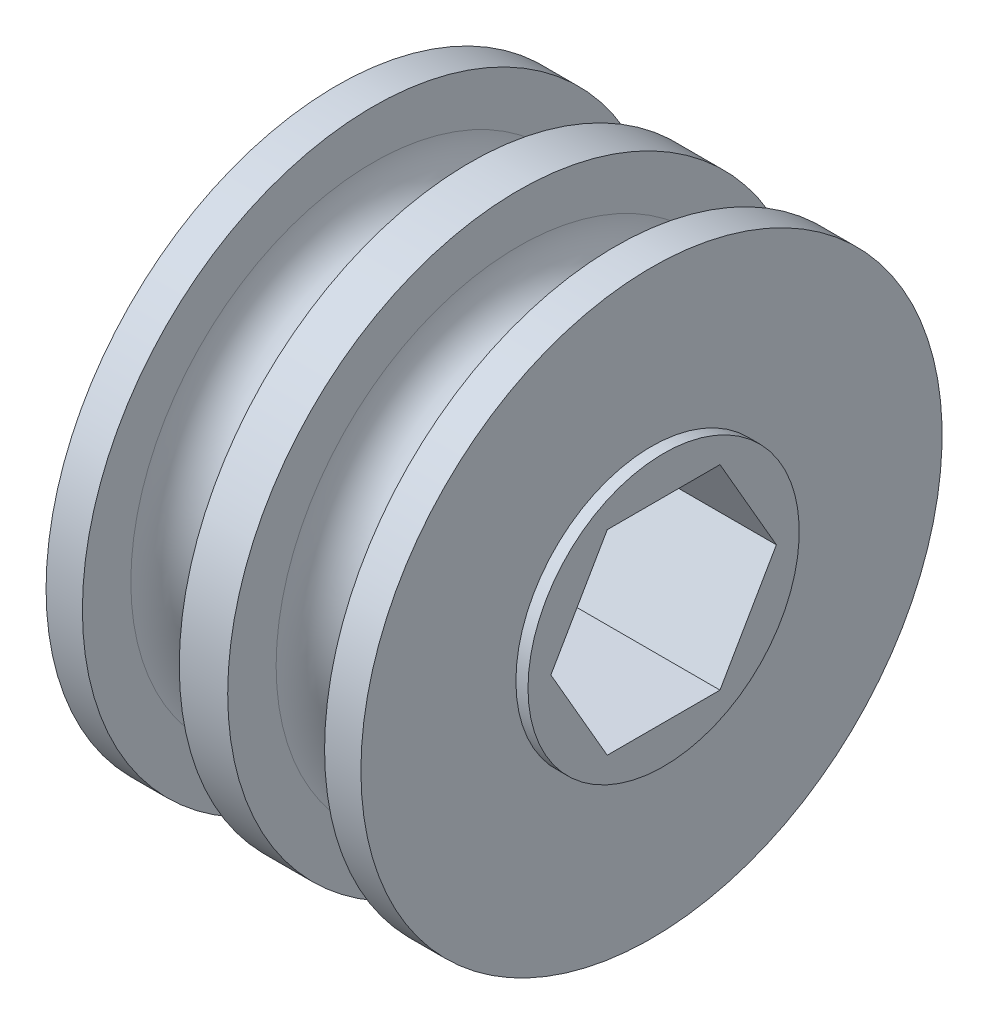
ISO-10303-21;
HEADER;
FILE_DESCRIPTION(('STEP AP214'),'2;1');
FILE_NAME('part.step','',(''),(''),'','','');
FILE_SCHEMA(('AUTOMOTIVE_DESIGN { 1 0 10303 214 1 1 1 1 }'));
ENDSEC;
DATA;
#1=APPLICATION_CONTEXT('core data for automotive mechanical design processes');
#2=APPLICATION_PROTOCOL_DEFINITION('international standard','automotive_design',2000,#1);
#3=PRODUCT_CONTEXT('',#1,'mechanical');
#4=PRODUCT('Part','Part','',(#3));
#5=PRODUCT_RELATED_PRODUCT_CATEGORY('part','',(#4));
#6=PRODUCT_DEFINITION_FORMATION('','',#4);
#7=PRODUCT_DEFINITION_CONTEXT('part definition',#1,'design');
#8=PRODUCT_DEFINITION('design','',#6,#7);
#9=PRODUCT_DEFINITION_SHAPE('','',#8);
#10=(LENGTH_UNIT() NAMED_UNIT(*) SI_UNIT(.MILLI.,.METRE.));
#11=(NAMED_UNIT(*) PLANE_ANGLE_UNIT() SI_UNIT($,.RADIAN.));
#12=(NAMED_UNIT(*) SI_UNIT($,.STERADIAN.) SOLID_ANGLE_UNIT());
#13=UNCERTAINTY_MEASURE_WITH_UNIT(LENGTH_MEASURE(1.E-05),#10,'distance_accuracy_value','');
#14=(GEOMETRIC_REPRESENTATION_CONTEXT(3) GLOBAL_UNCERTAINTY_ASSIGNED_CONTEXT((#13)) GLOBAL_UNIT_ASSIGNED_CONTEXT((#10,
#11,#12)) REPRESENTATION_CONTEXT('',''));
#15=CARTESIAN_POINT('',(0.,0.,0.));
#16=DIRECTION('',(0.,0.,1.));
#17=DIRECTION('',(1.,0.,0.));
#18=AXIS2_PLACEMENT_3D('',#15,#16,#17);
#19=CARTESIAN_POINT('',(-4.7625,0.,0.));
#20=DIRECTION('',(1.,0.,0.));
#21=DIRECTION('',(0.,0.,-1.));
#22=AXIS2_PLACEMENT_3D('',#19,#20,#21);
#23=TOROIDAL_SURFACE('',#22,15.875,3.175);
#24=CARTESIAN_POINT('',(-7.9375,0.,0.));
#25=DIRECTION('',(1.,0.,0.));
#26=DIRECTION('',(0.,0.,-1.));
#27=AXIS2_PLACEMENT_3D('',#24,#25,#26);
#28=CIRCLE('',#27,15.875);
#29=CARTESIAN_POINT('',(-7.9375,0.,-15.875));
#30=VERTEX_POINT('',#29);
#31=CARTESIAN_POINT('',(-7.9375,0.,15.875));
#32=VERTEX_POINT('',#31);
#33=EDGE_CURVE('E94',#30,#32,#28,.T.);
#34=ORIENTED_EDGE('',*,*,#33,.T.);
#35=CARTESIAN_POINT('',(-7.9375,0.,0.));
#36=DIRECTION('',(1.,0.,0.));
#37=DIRECTION('',(0.,0.,1.));
#38=AXIS2_PLACEMENT_3D('',#35,#36,#37);
#39=CIRCLE('',#38,15.875);
#40=EDGE_CURVE('E97',#32,#30,#39,.T.);
#41=ORIENTED_EDGE('',*,*,#40,.T.);
#42=EDGE_LOOP('',(#34,#41));
#43=FACE_BOUND('',#42,.T.);
#44=CARTESIAN_POINT('',(-1.5875,0.,0.));
#45=DIRECTION('',(-1.,0.,0.));
#46=DIRECTION('',(0.,0.,1.));
#47=AXIS2_PLACEMENT_3D('',#44,#45,#46);
#48=CIRCLE('',#47,15.875);
#49=CARTESIAN_POINT('',(-1.5875,0.,15.875));
#50=VERTEX_POINT('',#49);
#51=CARTESIAN_POINT('',(-1.5875,0.,-15.875));
#52=VERTEX_POINT('',#51);
#53=EDGE_CURVE('E241',#50,#52,#48,.T.);
#54=ORIENTED_EDGE('',*,*,#53,.T.);
#55=CARTESIAN_POINT('',(-1.5875,0.,0.));
#56=DIRECTION('',(-1.,0.,0.));
#57=DIRECTION('',(0.,0.,-1.));
#58=AXIS2_PLACEMENT_3D('',#55,#56,#57);
#59=CIRCLE('',#58,15.875);
#60=EDGE_CURVE('E105',#52,#50,#59,.T.);
#61=ORIENTED_EDGE('',*,*,#60,.T.);
#62=EDGE_LOOP('',(#54,#61));
#63=FACE_BOUND('',#62,.T.);
#64=ADVANCED_FACE('F16',(#43,#63),#23,.F.);
#65=CARTESIAN_POINT('',(-7.9375,0.,-19.05));
#66=DIRECTION('',(-1.,0.,0.));
#67=DIRECTION('',(0.,0.,1.));
#68=AXIS2_PLACEMENT_3D('',#65,#66,#67);
#69=PLANE('',#68);
#70=CARTESIAN_POINT('',(-7.9375,0.,0.));
#71=DIRECTION('',(-1.,0.,0.));
#72=DIRECTION('',(0.,0.,1.));
#73=AXIS2_PLACEMENT_3D('',#70,#71,#72);
#74=CIRCLE('',#73,19.05);
#75=CARTESIAN_POINT('',(-7.9375,0.,19.05));
#76=VERTEX_POINT('',#75);
#77=EDGE_CURVE('E275',#76,#76,#74,.T.);
#78=ORIENTED_EDGE('',*,*,#77,.F.);
#79=EDGE_LOOP('',(#78));
#80=FACE_BOUND('',#79,.T.);
#81=ORIENTED_EDGE('',*,*,#40,.F.);
#82=ORIENTED_EDGE('',*,*,#33,.F.);
#83=EDGE_LOOP('',(#81,#82));
#84=FACE_BOUND('',#83,.T.);
#85=ADVANCED_FACE('F99',(#80,#84),#69,.F.);
#86=CARTESIAN_POINT('',(-1.5875,0.,-12.7));
#87=DIRECTION('',(1.,0.,0.));
#88=DIRECTION('',(0.,0.,-1.));
#89=AXIS2_PLACEMENT_3D('',#86,#87,#88);
#90=PLANE('',#89);
#91=CARTESIAN_POINT('',(-1.5875,0.,0.));
#92=DIRECTION('',(-1.,0.,0.));
#93=DIRECTION('',(0.,0.,1.));
#94=AXIS2_PLACEMENT_3D('',#91,#92,#93);
#95=CIRCLE('',#94,19.05);
#96=CARTESIAN_POINT('',(-1.5875,0.,19.05));
#97=VERTEX_POINT('',#96);
#98=EDGE_CURVE('E272',#97,#97,#95,.F.);
#99=ORIENTED_EDGE('',*,*,#98,.F.);
#100=EDGE_LOOP('',(#99));
#101=FACE_BOUND('',#100,.T.);
#102=ORIENTED_EDGE('',*,*,#60,.F.);
#103=ORIENTED_EDGE('',*,*,#53,.F.);
#104=EDGE_LOOP('',(#102,#103));
#105=FACE_BOUND('',#104,.T.);
#106=ADVANCED_FACE('F205',(#101,#105),#90,.F.);
#107=CARTESIAN_POINT('',(-11.1125,0.,0.));
#108=DIRECTION('',(-1.,0.,0.));
#109=DIRECTION('',(0.,0.,1.));
#110=AXIS2_PLACEMENT_3D('',#107,#108,#109);
#111=CYLINDRICAL_SURFACE('',#110,19.05);
#112=CARTESIAN_POINT('',(-10.31875,0.,0.));
#113=DIRECTION('',(-1.,0.,0.));
#114=DIRECTION('',(0.,0.,1.));
#115=AXIS2_PLACEMENT_3D('',#112,#113,#114);
#116=CIRCLE('',#115,19.05);
#117=CARTESIAN_POINT('',(-10.31875,0.,19.05));
#118=VERTEX_POINT('',#117);
#119=EDGE_CURVE('E269',#118,#118,#116,.F.);
#120=ORIENTED_EDGE('',*,*,#119,.T.);
#121=EDGE_LOOP('',(#120));
#122=FACE_BOUND('',#121,.T.);
#123=ORIENTED_EDGE('',*,*,#77,.T.);
#124=EDGE_LOOP('',(#123));
#125=FACE_BOUND('',#124,.T.);
#126=ADVANCED_FACE('F214',(#122,#125),#111,.T.);
#127=CARTESIAN_POINT('',(-11.1125,0.,0.));
#128=DIRECTION('',(-1.,0.,0.));
#129=DIRECTION('',(0.,0.,1.));
#130=AXIS2_PLACEMENT_3D('',#127,#128,#129);
#131=CYLINDRICAL_SURFACE('',#130,19.05);
#132=ORIENTED_EDGE('',*,*,#98,.T.);
#133=EDGE_LOOP('',(#132));
#134=FACE_BOUND('',#133,.T.);
#135=CARTESIAN_POINT('',(1.5875,0.,0.));
#136=DIRECTION('',(-1.,0.,0.));
#137=DIRECTION('',(0.,0.,1.));
#138=AXIS2_PLACEMENT_3D('',#135,#136,#137);
#139=CIRCLE('',#138,19.05);
#140=CARTESIAN_POINT('',(1.5875,0.,19.05));
#141=VERTEX_POINT('',#140);
#142=EDGE_CURVE('E266',#141,#141,#139,.T.);
#143=ORIENTED_EDGE('',*,*,#142,.T.);
#144=EDGE_LOOP('',(#143));
#145=FACE_BOUND('',#144,.T.);
#146=ADVANCED_FACE('F486',(#134,#145),#131,.T.);
#147=CARTESIAN_POINT('',(-10.31875,0.,-8.89));
#148=DIRECTION('',(1.,0.,0.));
#149=DIRECTION('',(0.,0.,-1.));
#150=AXIS2_PLACEMENT_3D('',#147,#148,#149);
#151=PLANE('',#150);
#152=ORIENTED_EDGE('',*,*,#119,.F.);
#153=EDGE_LOOP('',(#152));
#154=FACE_BOUND('',#153,.T.);
#155=CARTESIAN_POINT('',(-10.31875,0.,0.));
#156=DIRECTION('',(-1.,0.,0.));
#157=DIRECTION('',(0.,0.,1.));
#158=AXIS2_PLACEMENT_3D('',#155,#156,#157);
#159=CIRCLE('',#158,8.89);
#160=CARTESIAN_POINT('',(-10.31875,0.,8.89));
#161=VERTEX_POINT('',#160);
#162=EDGE_CURVE('E263',#161,#161,#159,.T.);
#163=ORIENTED_EDGE('',*,*,#162,.F.);
#164=EDGE_LOOP('',(#163));
#165=FACE_BOUND('',#164,.T.);
#166=ADVANCED_FACE('F187',(#154,#165),#151,.F.);
#167=CARTESIAN_POINT('',(1.5875,0.,-19.05));
#168=DIRECTION('',(-1.,0.,0.));
#169=DIRECTION('',(0.,0.,1.));
#170=AXIS2_PLACEMENT_3D('',#167,#168,#169);
#171=PLANE('',#170);
#172=ORIENTED_EDGE('',*,*,#142,.F.);
#173=EDGE_LOOP('',(#172));
#174=FACE_BOUND('',#173,.T.);
#175=CARTESIAN_POINT('',(1.5875,0.,0.));
#176=DIRECTION('',(1.,0.,0.));
#177=DIRECTION('',(0.,0.,1.));
#178=AXIS2_PLACEMENT_3D('',#175,#176,#177);
#179=CIRCLE('',#178,15.875);
#180=CARTESIAN_POINT('',(1.5875,0.,-15.875));
#181=VERTEX_POINT('',#180);
#182=CARTESIAN_POINT('',(1.58750000000001,0.,15.875));
#183=VERTEX_POINT('',#182);
#184=EDGE_CURVE('E170',#181,#183,#179,.F.);
#185=ORIENTED_EDGE('',*,*,#184,.T.);
#186=CARTESIAN_POINT('',(1.5875,0.,0.));
#187=DIRECTION('',(1.,0.,0.));
#188=DIRECTION('',(0.,0.,-1.));
#189=AXIS2_PLACEMENT_3D('',#186,#187,#188);
#190=CIRCLE('',#189,15.875);
#191=EDGE_CURVE('E262',#183,#181,#190,.F.);
#192=ORIENTED_EDGE('',*,*,#191,.T.);
#193=EDGE_LOOP('',(#185,#192));
#194=FACE_BOUND('',#193,.T.);
#195=ADVANCED_FACE('F177',(#174,#194),#171,.F.);
#196=CARTESIAN_POINT('',(-11.1125,0.,0.));
#197=DIRECTION('',(-1.,0.,0.));
#198=DIRECTION('',(0.,0.,1.));
#199=AXIS2_PLACEMENT_3D('',#196,#197,#198);
#200=CYLINDRICAL_SURFACE('',#199,8.89);
#201=CARTESIAN_POINT('',(-11.1125,0.,0.));
#202=DIRECTION('',(-1.,0.,0.));
#203=DIRECTION('',(0.,0.,1.));
#204=AXIS2_PLACEMENT_3D('',#201,#202,#203);
#205=CIRCLE('',#204,8.89);
#206=CARTESIAN_POINT('',(-11.1125,0.,8.89));
#207=VERTEX_POINT('',#206);
#208=EDGE_CURVE('E259',#207,#207,#205,.F.);
#209=ORIENTED_EDGE('',*,*,#208,.T.);
#210=EDGE_LOOP('',(#209));
#211=FACE_BOUND('',#210,.T.);
#212=ORIENTED_EDGE('',*,*,#162,.T.);
#213=EDGE_LOOP('',(#212));
#214=FACE_BOUND('',#213,.T.);
#215=ADVANCED_FACE('F186',(#211,#214),#200,.T.);
#216=CARTESIAN_POINT('',(-11.1125,0.,-6.4008));
#217=DIRECTION('',(1.,0.,0.));
#218=DIRECTION('',(0.,0.,-1.));
#219=AXIS2_PLACEMENT_3D('',#216,#217,#218);
#220=PLANE('',#219);
#221=ORIENTED_EDGE('',*,*,#208,.F.);
#222=EDGE_LOOP('',(#221));
#223=FACE_BOUND('',#222,.T.);
#224=DIRECTION('',(0.,-0.866025403784439,-0.5));
#225=VECTOR('',#224,1.);
#226=CARTESIAN_POINT('',(-11.1125,-6.40079999999999,3.69550360302895));
#227=LINE('',#226,#225);
#228=CARTESIAN_POINT('',(-11.1125,0.,7.39100720605791));
#229=VERTEX_POINT('',#228);
#230=CARTESIAN_POINT('',(-11.1125,-6.40079999999999,3.69550360302895));
#231=VERTEX_POINT('',#230);
#232=EDGE_CURVE('E322',#229,#231,#227,.T.);
#233=ORIENTED_EDGE('',*,*,#232,.T.);
#234=DIRECTION('',(0.,0.,-1.));
#235=VECTOR('',#234,1.);
#236=CARTESIAN_POINT('',(-11.1125,-6.40079999999999,-3.69550360302896));
#237=LINE('',#236,#235);
#238=CARTESIAN_POINT('',(-11.1125,-6.40079999999999,-3.69550360302895));
#239=VERTEX_POINT('',#238);
#240=EDGE_CURVE('E317',#231,#239,#237,.T.);
#241=ORIENTED_EDGE('',*,*,#240,.T.);
#242=DIRECTION('',(0.,0.866025403784439,-0.5));
#243=VECTOR('',#242,1.);
#244=CARTESIAN_POINT('',(-11.1125,0.,-7.39100720605791));
#245=LINE('',#244,#243);
#246=CARTESIAN_POINT('',(-11.1125,0.,-7.39100720605791));
#247=VERTEX_POINT('',#246);
#248=EDGE_CURVE('E312',#239,#247,#245,.T.);
#249=ORIENTED_EDGE('',*,*,#248,.T.);
#250=DIRECTION('',(0.,0.866025403784439,0.5));
#251=VECTOR('',#250,1.);
#252=CARTESIAN_POINT('',(-11.1125,6.4008,-3.69550360302895));
#253=LINE('',#252,#251);
#254=CARTESIAN_POINT('',(-11.1125,6.4008,-3.69550360302895));
#255=VERTEX_POINT('',#254);
#256=EDGE_CURVE('E297',#247,#255,#253,.T.);
#257=ORIENTED_EDGE('',*,*,#256,.T.);
#258=DIRECTION('',(0.,0.,1.));
#259=VECTOR('',#258,1.);
#260=CARTESIAN_POINT('',(-11.1125,6.4008,3.69550360302895));
#261=LINE('',#260,#259);
#262=CARTESIAN_POINT('',(-11.1125,6.4008,3.69550360302895));
#263=VERTEX_POINT('',#262);
#264=EDGE_CURVE('E153',#255,#263,#261,.T.);
#265=ORIENTED_EDGE('',*,*,#264,.T.);
#266=DIRECTION('',(0.,-0.866025403784439,0.5));
#267=VECTOR('',#266,1.);
#268=CARTESIAN_POINT('',(-11.1125,0.,7.39100720605791));
#269=LINE('',#268,#267);
#270=EDGE_CURVE('E327',#263,#229,#269,.T.);
#271=ORIENTED_EDGE('',*,*,#270,.T.);
#272=EDGE_LOOP('',(#233,#241,#249,#257,#265,#271));
#273=FACE_BOUND('',#272,.T.);
#274=ADVANCED_FACE('F143',(#223,#273),#220,.F.);
#275=CARTESIAN_POINT('',(4.7625,0.,0.));
#276=DIRECTION('',(1.,0.,0.));
#277=DIRECTION('',(0.,0.,-1.));
#278=AXIS2_PLACEMENT_3D('',#275,#276,#277);
#279=TOROIDAL_SURFACE('',#278,15.875,3.175);
#280=ORIENTED_EDGE('',*,*,#191,.F.);
#281=ORIENTED_EDGE('',*,*,#184,.F.);
#282=EDGE_LOOP('',(#280,#281));
#283=FACE_BOUND('',#282,.T.);
#284=CARTESIAN_POINT('',(7.9375,0.,0.));
#285=DIRECTION('',(-1.,0.,0.));
#286=DIRECTION('',(0.,0.,1.));
#287=AXIS2_PLACEMENT_3D('',#284,#285,#286);
#288=CIRCLE('',#287,15.875);
#289=CARTESIAN_POINT('',(7.9375,0.,15.875));
#290=VERTEX_POINT('',#289);
#291=CARTESIAN_POINT('',(7.9375,0.,-15.875));
#292=VERTEX_POINT('',#291);
#293=EDGE_CURVE('E158',#290,#292,#288,.T.);
#294=ORIENTED_EDGE('',*,*,#293,.T.);
#295=CARTESIAN_POINT('',(7.9375,0.,0.));
#296=DIRECTION('',(-1.,0.,0.));
#297=DIRECTION('',(0.,0.,-1.));
#298=AXIS2_PLACEMENT_3D('',#295,#296,#297);
#299=CIRCLE('',#298,15.875);
#300=EDGE_CURVE('E279',#292,#290,#299,.T.);
#301=ORIENTED_EDGE('',*,*,#300,.T.);
#302=EDGE_LOOP('',(#294,#301));
#303=FACE_BOUND('',#302,.T.);
#304=ADVANCED_FACE('F131',(#283,#303),#279,.F.);
#305=CARTESIAN_POINT('',(11.1125,6.4008,3.69550360302895));
#306=DIRECTION('',(0.,1.,0.));
#307=DIRECTION('',(0.,0.,1.));
#308=AXIS2_PLACEMENT_3D('',#305,#306,#307);
#309=PLANE('',#308);
#310=DIRECTION('',(1.,0.,0.));
#311=VECTOR('',#310,1.);
#312=CARTESIAN_POINT('',(11.1125,6.4008,-3.69550360302895));
#313=LINE('',#312,#311);
#314=CARTESIAN_POINT('',(11.1125,6.4008,-3.69550360302896));
#315=VERTEX_POINT('',#314);
#316=EDGE_CURVE('E302',#255,#315,#313,.T.);
#317=ORIENTED_EDGE('',*,*,#316,.T.);
#318=DIRECTION('',(0.,0.,1.));
#319=VECTOR('',#318,1.);
#320=CARTESIAN_POINT('',(11.1125,6.4008,-8.89));
#321=LINE('',#320,#319);
#322=CARTESIAN_POINT('',(11.1125,6.4008,3.69550360302895));
#323=VERTEX_POINT('',#322);
#324=EDGE_CURVE('E298',#315,#323,#321,.T.);
#325=ORIENTED_EDGE('',*,*,#324,.T.);
#326=DIRECTION('',(1.,0.,0.));
#327=VECTOR('',#326,1.);
#328=CARTESIAN_POINT('',(11.1125,6.4008,3.69550360302895));
#329=LINE('',#328,#327);
#330=EDGE_CURVE('E328',#323,#263,#329,.F.);
#331=ORIENTED_EDGE('',*,*,#330,.T.);
#332=ORIENTED_EDGE('',*,*,#264,.F.);
#333=EDGE_LOOP('',(#317,#325,#331,#332));
#334=FACE_BOUND('',#333,.T.);
#335=ADVANCED_FACE('F142',(#334),#309,.F.);
#336=CARTESIAN_POINT('',(11.1125,0.,7.3910072060579));
#337=DIRECTION('',(0.,0.5,0.866025403784439));
#338=DIRECTION('',(0.,-0.866025403784439,0.5));
#339=AXIS2_PLACEMENT_3D('',#336,#337,#338);
#340=PLANE('',#339);
#341=ORIENTED_EDGE('',*,*,#330,.F.);
#342=DIRECTION('',(0.,-0.866025403784439,0.5));
#343=VECTOR('',#342,1.);
#344=CARTESIAN_POINT('',(11.1125,6.4008,3.69550360302895));
#345=LINE('',#344,#343);
#346=CARTESIAN_POINT('',(11.1125,0.,7.3910072060579));
#347=VERTEX_POINT('',#346);
#348=EDGE_CURVE('E339',#323,#347,#345,.T.);
#349=ORIENTED_EDGE('',*,*,#348,.T.);
#350=DIRECTION('',(1.,0.,0.));
#351=VECTOR('',#350,1.);
#352=CARTESIAN_POINT('',(11.1125,0.,7.3910072060579));
#353=LINE('',#352,#351);
#354=EDGE_CURVE('E324',#347,#229,#353,.F.);
#355=ORIENTED_EDGE('',*,*,#354,.T.);
#356=ORIENTED_EDGE('',*,*,#270,.F.);
#357=EDGE_LOOP('',(#341,#349,#355,#356));
#358=FACE_BOUND('',#357,.T.);
#359=ADVANCED_FACE('F336',(#358),#340,.F.);
#360=CARTESIAN_POINT('',(11.1125,-6.40079999999999,3.69550360302895));
#361=DIRECTION('',(0.,-0.5,0.866025403784439));
#362=DIRECTION('',(0.,-0.866025403784439,-0.5));
#363=AXIS2_PLACEMENT_3D('',#360,#361,#362);
#364=PLANE('',#363);
#365=ORIENTED_EDGE('',*,*,#354,.F.);
#366=DIRECTION('',(0.,-0.866025403784439,-0.5));
#367=VECTOR('',#366,1.);
#368=CARTESIAN_POINT('',(11.1125,0.,7.39100720605791));
#369=LINE('',#368,#367);
#370=CARTESIAN_POINT('',(11.1125,-6.40079999999999,3.69550360302895));
#371=VERTEX_POINT('',#370);
#372=EDGE_CURVE('E344',#347,#371,#369,.T.);
#373=ORIENTED_EDGE('',*,*,#372,.T.);
#374=DIRECTION('',(1.,0.,0.));
#375=VECTOR('',#374,1.);
#376=CARTESIAN_POINT('',(11.1125,-6.40079999999999,3.69550360302895));
#377=LINE('',#376,#375);
#378=EDGE_CURVE('E319',#371,#231,#377,.F.);
#379=ORIENTED_EDGE('',*,*,#378,.T.);
#380=ORIENTED_EDGE('',*,*,#232,.F.);
#381=EDGE_LOOP('',(#365,#373,#379,#380));
#382=FACE_BOUND('',#381,.T.);
#383=ADVANCED_FACE('F343',(#382),#364,.F.);
#384=CARTESIAN_POINT('',(11.1125,-6.40079999999999,-3.69550360302896));
#385=DIRECTION('',(0.,-1.,0.));
#386=DIRECTION('',(0.,0.,-1.));
#387=AXIS2_PLACEMENT_3D('',#384,#385,#386);
#388=PLANE('',#387);
#389=ORIENTED_EDGE('',*,*,#378,.F.);
#390=DIRECTION('',(0.,0.,1.));
#391=VECTOR('',#390,1.);
#392=CARTESIAN_POINT('',(11.1125,-6.40079999999999,-8.89));
#393=LINE('',#392,#391);
#394=CARTESIAN_POINT('',(11.1125,-6.40079999999999,-3.69550360302896));
#395=VERTEX_POINT('',#394);
#396=EDGE_CURVE('E351',#371,#395,#393,.F.);
#397=ORIENTED_EDGE('',*,*,#396,.T.);
#398=DIRECTION('',(1.,0.,0.));
#399=VECTOR('',#398,1.);
#400=CARTESIAN_POINT('',(11.1125,-6.40079999999999,-3.69550360302896));
#401=LINE('',#400,#399);
#402=EDGE_CURVE('E314',#395,#239,#401,.F.);
#403=ORIENTED_EDGE('',*,*,#402,.T.);
#404=ORIENTED_EDGE('',*,*,#240,.F.);
#405=EDGE_LOOP('',(#389,#397,#403,#404));
#406=FACE_BOUND('',#405,.T.);
#407=ADVANCED_FACE('F380',(#406),#388,.F.);
#408=CARTESIAN_POINT('',(11.1125,0.,-7.39100720605791));
#409=DIRECTION('',(0.,-0.5,-0.866025403784439));
#410=DIRECTION('',(0.,0.866025403784439,-0.5));
#411=AXIS2_PLACEMENT_3D('',#408,#409,#410);
#412=PLANE('',#411);
#413=ORIENTED_EDGE('',*,*,#402,.F.);
#414=DIRECTION('',(0.,0.866025403784439,-0.5));
#415=VECTOR('',#414,1.);
#416=CARTESIAN_POINT('',(11.1125,-6.40079999999999,-3.69550360302896));
#417=LINE('',#416,#415);
#418=CARTESIAN_POINT('',(11.1125,0.,-7.39100720605791));
#419=VERTEX_POINT('',#418);
#420=EDGE_CURVE('E353',#395,#419,#417,.T.);
#421=ORIENTED_EDGE('',*,*,#420,.T.);
#422=DIRECTION('',(1.,0.,0.));
#423=VECTOR('',#422,1.);
#424=CARTESIAN_POINT('',(11.1125,0.,-7.39100720605791));
#425=LINE('',#424,#423);
#426=EDGE_CURVE('E37',#419,#247,#425,.F.);
#427=ORIENTED_EDGE('',*,*,#426,.T.);
#428=ORIENTED_EDGE('',*,*,#248,.F.);
#429=EDGE_LOOP('',(#413,#421,#427,#428));
#430=FACE_BOUND('',#429,.T.);
#431=ADVANCED_FACE('F377',(#430),#412,.F.);
#432=CARTESIAN_POINT('',(11.1125,6.4008,-3.69550360302896));
#433=DIRECTION('',(0.,0.5,-0.866025403784439));
#434=DIRECTION('',(0.,0.866025403784439,0.5));
#435=AXIS2_PLACEMENT_3D('',#432,#433,#434);
#436=PLANE('',#435);
#437=ORIENTED_EDGE('',*,*,#426,.F.);
#438=DIRECTION('',(0.,0.866025403784439,0.5));
#439=VECTOR('',#438,1.);
#440=CARTESIAN_POINT('',(11.1125,0.,-7.39100720605791));
#441=LINE('',#440,#439);
#442=EDGE_CURVE('E258',#419,#315,#441,.T.);
#443=ORIENTED_EDGE('',*,*,#442,.T.);
#444=ORIENTED_EDGE('',*,*,#316,.F.);
#445=ORIENTED_EDGE('',*,*,#256,.F.);
#446=EDGE_LOOP('',(#437,#443,#444,#445));
#447=FACE_BOUND('',#446,.T.);
#448=ADVANCED_FACE('F371',(#447),#436,.F.);
#449=CARTESIAN_POINT('',(7.9375,0.,-12.7));
#450=DIRECTION('',(1.,0.,0.));
#451=DIRECTION('',(0.,0.,-1.));
#452=AXIS2_PLACEMENT_3D('',#449,#450,#451);
#453=PLANE('',#452);
#454=CARTESIAN_POINT('',(7.9375,0.,0.));
#455=DIRECTION('',(-1.,0.,0.));
#456=DIRECTION('',(0.,0.,1.));
#457=AXIS2_PLACEMENT_3D('',#454,#455,#456);
#458=CIRCLE('',#457,19.05);
#459=CARTESIAN_POINT('',(7.9375,0.,19.05));
#460=VERTEX_POINT('',#459);
#461=EDGE_CURVE('E255',#460,#460,#458,.F.);
#462=ORIENTED_EDGE('',*,*,#461,.F.);
#463=EDGE_LOOP('',(#462));
#464=FACE_BOUND('',#463,.T.);
#465=ORIENTED_EDGE('',*,*,#300,.F.);
#466=ORIENTED_EDGE('',*,*,#293,.F.);
#467=EDGE_LOOP('',(#465,#466));
#468=FACE_BOUND('',#467,.T.);
#469=ADVANCED_FACE('F361',(#464,#468),#453,.F.);
#470=CARTESIAN_POINT('',(11.1125,0.,-8.89));
#471=DIRECTION('',(-1.,0.,0.));
#472=DIRECTION('',(0.,0.,1.));
#473=AXIS2_PLACEMENT_3D('',#470,#471,#472);
#474=PLANE('',#473);
#475=ORIENTED_EDGE('',*,*,#420,.F.);
#476=ORIENTED_EDGE('',*,*,#396,.F.);
#477=ORIENTED_EDGE('',*,*,#372,.F.);
#478=ORIENTED_EDGE('',*,*,#348,.F.);
#479=ORIENTED_EDGE('',*,*,#324,.F.);
#480=ORIENTED_EDGE('',*,*,#442,.F.);
#481=EDGE_LOOP('',(#475,#476,#477,#478,#479,#480));
#482=FACE_BOUND('',#481,.T.);
#483=CARTESIAN_POINT('',(11.1125,0.,0.));
#484=DIRECTION('',(-1.,0.,0.));
#485=DIRECTION('',(0.,0.,1.));
#486=AXIS2_PLACEMENT_3D('',#483,#484,#485);
#487=CIRCLE('',#486,8.89);
#488=CARTESIAN_POINT('',(11.1125,0.,8.89));
#489=VERTEX_POINT('',#488);
#490=EDGE_CURVE('E252',#489,#489,#487,.T.);
#491=ORIENTED_EDGE('',*,*,#490,.F.);
#492=EDGE_LOOP('',(#491));
#493=FACE_BOUND('',#492,.T.);
#494=ADVANCED_FACE('F348',(#482,#493),#474,.F.);
#495=CARTESIAN_POINT('',(-11.1125,0.,0.));
#496=DIRECTION('',(-1.,0.,0.));
#497=DIRECTION('',(0.,0.,1.));
#498=AXIS2_PLACEMENT_3D('',#495,#496,#497);
#499=CYLINDRICAL_SURFACE('',#498,19.05);
#500=ORIENTED_EDGE('',*,*,#461,.T.);
#501=EDGE_LOOP('',(#500));
#502=FACE_BOUND('',#501,.T.);
#503=CARTESIAN_POINT('',(10.31875,0.,0.));
#504=DIRECTION('',(-1.,0.,0.));
#505=DIRECTION('',(0.,0.,1.));
#506=AXIS2_PLACEMENT_3D('',#503,#504,#505);
#507=CIRCLE('',#506,19.05);
#508=CARTESIAN_POINT('',(10.31875,0.,19.05));
#509=VERTEX_POINT('',#508);
#510=EDGE_CURVE('E28',#509,#509,#507,.T.);
#511=ORIENTED_EDGE('',*,*,#510,.T.);
#512=EDGE_LOOP('',(#511));
#513=FACE_BOUND('',#512,.T.);
#514=ADVANCED_FACE('F399',(#502,#513),#499,.T.);
#515=CARTESIAN_POINT('',(-11.1125,0.,0.));
#516=DIRECTION('',(-1.,0.,0.));
#517=DIRECTION('',(0.,0.,1.));
#518=AXIS2_PLACEMENT_3D('',#515,#516,#517);
#519=CYLINDRICAL_SURFACE('',#518,8.89);
#520=CARTESIAN_POINT('',(10.31875,0.,0.));
#521=DIRECTION('',(-1.,0.,0.));
#522=DIRECTION('',(0.,0.,1.));
#523=AXIS2_PLACEMENT_3D('',#520,#521,#522);
#524=CIRCLE('',#523,8.89);
#525=CARTESIAN_POINT('',(10.31875,0.,8.89));
#526=VERTEX_POINT('',#525);
#527=EDGE_CURVE('E9',#526,#526,#524,.F.);
#528=ORIENTED_EDGE('',*,*,#527,.T.);
#529=EDGE_LOOP('',(#528));
#530=FACE_BOUND('',#529,.T.);
#531=ORIENTED_EDGE('',*,*,#490,.T.);
#532=EDGE_LOOP('',(#531));
#533=FACE_BOUND('',#532,.T.);
#534=ADVANCED_FACE('F393',(#530,#533),#519,.T.);
#535=CARTESIAN_POINT('',(10.31875,0.,-19.05));
#536=DIRECTION('',(-1.,0.,0.));
#537=DIRECTION('',(0.,0.,1.));
#538=AXIS2_PLACEMENT_3D('',#535,#536,#537);
#539=PLANE('',#538);
#540=ORIENTED_EDGE('',*,*,#527,.F.);
#541=EDGE_LOOP('',(#540));
#542=FACE_BOUND('',#541,.T.);
#543=ORIENTED_EDGE('',*,*,#510,.F.);
#544=EDGE_LOOP('',(#543));
#545=FACE_BOUND('',#544,.T.);
#546=ADVANCED_FACE('F391',(#542,#545),#539,.F.);
#547=CLOSED_SHELL('',(#64,#85,#106,#126,#146,#166,#195,#215,#274,#304,#335,#359,#383,#407,#431,
#448,#469,#494,#514,#534,#546));
#548=MANIFOLD_SOLID_BREP('B1',#547);
#549=ADVANCED_BREP_SHAPE_REPRESENTATION('',(#18,#548),#14);
#550=SHAPE_DEFINITION_REPRESENTATION(#9,#549);
ENDSEC;
END-ISO-10303-21;
